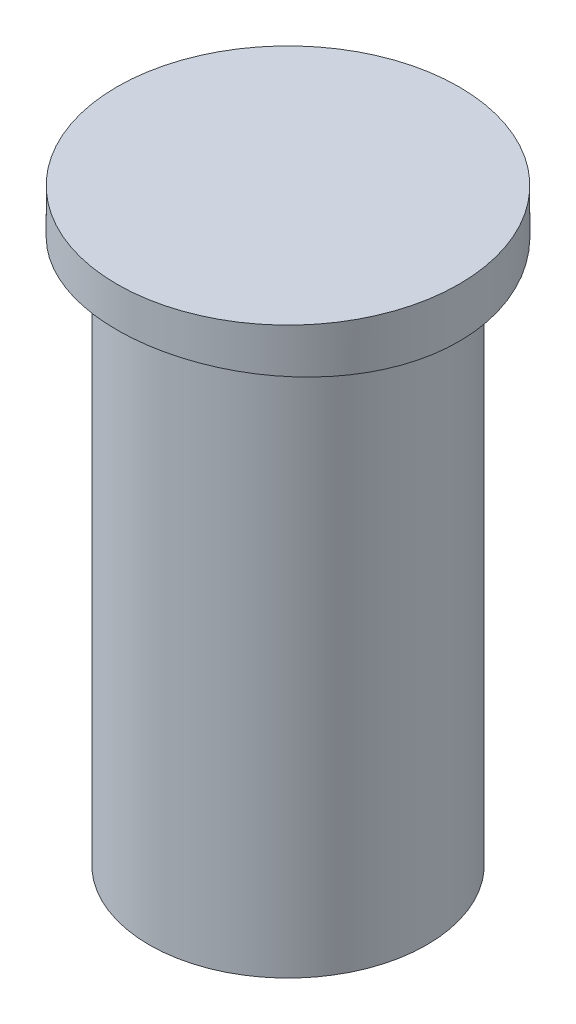
ISO-10303-21;
HEADER;
FILE_DESCRIPTION(('STEP AP214'),'2;1');
FILE_NAME('part.step','',(''),(''),'','','');
FILE_SCHEMA(('AUTOMOTIVE_DESIGN { 1 0 10303 214 1 1 1 1 }'));
ENDSEC;
DATA;
#1=APPLICATION_CONTEXT('core data for automotive mechanical design processes');
#2=APPLICATION_PROTOCOL_DEFINITION('international standard','automotive_design',2000,#1);
#3=PRODUCT_CONTEXT('',#1,'mechanical');
#4=PRODUCT('Part','Part','',(#3));
#5=PRODUCT_RELATED_PRODUCT_CATEGORY('part','',(#4));
#6=PRODUCT_DEFINITION_FORMATION('','',#4);
#7=PRODUCT_DEFINITION_CONTEXT('part definition',#1,'design');
#8=PRODUCT_DEFINITION('design','',#6,#7);
#9=PRODUCT_DEFINITION_SHAPE('','',#8);
#10=(LENGTH_UNIT() NAMED_UNIT(*) SI_UNIT(.MILLI.,.METRE.));
#11=(NAMED_UNIT(*) PLANE_ANGLE_UNIT() SI_UNIT($,.RADIAN.));
#12=(NAMED_UNIT(*) SI_UNIT($,.STERADIAN.) SOLID_ANGLE_UNIT());
#13=UNCERTAINTY_MEASURE_WITH_UNIT(LENGTH_MEASURE(1.E-05),#10,'distance_accuracy_value','');
#14=(GEOMETRIC_REPRESENTATION_CONTEXT(3) GLOBAL_UNCERTAINTY_ASSIGNED_CONTEXT((#13)) GLOBAL_UNIT_ASSIGNED_CONTEXT((#10,
#11,#12)) REPRESENTATION_CONTEXT('',''));
#15=CARTESIAN_POINT('',(0.,0.,0.));
#16=DIRECTION('',(0.,0.,1.));
#17=DIRECTION('',(1.,0.,0.));
#18=AXIS2_PLACEMENT_3D('',#15,#16,#17);
#19=CARTESIAN_POINT('',(0.,26.2128,0.));
#20=DIRECTION('',(0.,-1.,0.));
#21=DIRECTION('',(0.,0.,-1.));
#22=AXIS2_PLACEMENT_3D('',#19,#20,#21);
#23=CYLINDRICAL_SURFACE('',#22,7.62);
#24=CARTESIAN_POINT('',(0.,26.2128,0.));
#25=DIRECTION('',(0.,1.,0.));
#26=DIRECTION('',(0.,0.,1.));
#27=AXIS2_PLACEMENT_3D('',#24,#25,#26);
#28=CIRCLE('',#27,7.62);
#29=CARTESIAN_POINT('',(0.,26.2128,7.62));
#30=VERTEX_POINT('',#29);
#31=EDGE_CURVE('E11',#30,#30,#28,.T.);
#32=ORIENTED_EDGE('',*,*,#31,.F.);
#33=EDGE_LOOP('',(#32));
#34=FACE_BOUND('',#33,.T.);
#35=CARTESIAN_POINT('',(0.,24.4484000551112,-7.62));
#36=CARTESIAN_POINT('',(-0.213309301844703,24.4484007826591,-7.62000231755182));
#37=CARTESIAN_POINT('',(-0.426584098847539,24.4473544631542,-7.61103987355529));
#38=CARTESIAN_POINT('',(-0.85167813294983,24.4431999726027,-7.57525808419976));
#39=CARTESIAN_POINT('',(-1.06349702165712,24.4400913242933,-7.54843460544647));
#40=CARTESIAN_POINT('',(-1.48425674306282,24.4318954503537,-7.47709536160163));
#41=CARTESIAN_POINT('',(-1.69319525096377,24.4268067134718,-7.43256608244371));
#42=CARTESIAN_POINT('',(-2.10662512085482,24.4147924105843,-7.32612509078066));
#43=CARTESIAN_POINT('',(-2.31111482483329,24.4078661720376,-7.26420701334011));
#44=CARTESIAN_POINT('',(-2.71391316845633,24.3923808122444,-7.12352017728956));
#45=CARTESIAN_POINT('',(-2.91222790923823,24.383823366374,-7.04476869790152));
#46=CARTESIAN_POINT('',(-3.30157531073616,24.365307771398,-6.87091488392796));
#47=CARTESIAN_POINT('',(-3.49260525792306,24.3553491067033,-6.77580652783054));
#48=CARTESIAN_POINT('',(-3.86586794793223,24.3343183996452,-6.56999701082601));
#49=CARTESIAN_POINT('',(-4.04810552913065,24.3232469802085,-6.4593045602298));
#50=CARTESIAN_POINT('',(-4.4026983794659,24.3002913047856,-6.22302619184021));
#51=CARTESIAN_POINT('',(-4.57504995754689,24.2884067487903,-6.09743476434645));
#52=CARTESIAN_POINT('',(-4.90925940653562,24.2641129063189,-5.83175115020394));
#53=CARTESIAN_POINT('',(-5.07107344701722,24.2517017438222,-5.691603997217));
#54=CARTESIAN_POINT('',(-5.3823938656701,24.2267435019434,-5.39814898240186));
#55=CARTESIAN_POINT('',(-5.53189567080015,24.2141963740013,-5.24483627339297));
#56=CARTESIAN_POINT('',(-5.81745884001042,24.1893265785569,-4.92618885630274));
#57=CARTESIAN_POINT('',(-5.95352210299385,24.1770038795436,-4.76085585247071));
#58=CARTESIAN_POINT('',(-6.21127712358077,24.1529294845448,-4.41929990748995));
#59=CARTESIAN_POINT('',(-6.33296867428133,24.1411777967815,-4.24307680961716));
#60=CARTESIAN_POINT('',(-6.56144647326084,24.118546372747,-3.88044818787453));
#61=CARTESIAN_POINT('',(-6.66818849177072,24.1076692628207,-3.69401462817467));
#62=CARTESIAN_POINT('',(-6.86558162741164,24.0871366209234,-3.31274399198257));
#63=CARTESIAN_POINT('',(-6.95623232833622,24.0774811205517,-3.11790669828736));
#64=CARTESIAN_POINT('',(-7.12076218981935,24.0596720286792,-2.72125636999965));
#65=CARTESIAN_POINT('',(-7.19464490191408,24.0515181192039,-2.51944482303948));
#66=CARTESIAN_POINT('',(-7.32514226827467,24.0369430594094,-2.11017508981697));
#67=CARTESIAN_POINT('',(-7.38175097115909,24.0305225063678,-1.90271498422057));
#68=CARTESIAN_POINT('',(-7.47701887601645,24.0196303562942,-1.48469695705839));
#69=CARTESIAN_POINT('',(-7.51576173167152,24.0151496822817,-1.27415833518056));
#70=CARTESIAN_POINT('',(-7.57540418464727,24.0082226903286,-0.850532533189693));
#71=CARTESIAN_POINT('',(-7.59630358760403,24.005776394548,-0.637445325341224));
#72=CARTESIAN_POINT('',(-7.62010162474579,24.0029891903348,-0.210264774690897));
#73=CARTESIAN_POINT('',(-7.62300114190788,24.0026481786284,0.00382851824225737));
#74=CARTESIAN_POINT('',(-7.61078011830422,24.0040811515484,0.431497240297664));
#75=CARTESIAN_POINT('',(-7.59565922535986,24.0058551775097,0.6450726592172));
#76=CARTESIAN_POINT('',(-7.54763295160396,24.0114525207322,1.06907531272079));
#77=CARTESIAN_POINT('',(-7.51481933509633,24.0152652632358,1.27951308387396));
#78=CARTESIAN_POINT('',(-7.43169795187057,24.0248253824439,1.69693127158621));
#79=CARTESIAN_POINT('',(-7.38138416474365,24.0305734249084,1.90391047261317));
#80=CARTESIAN_POINT('',(-7.26364140016612,24.0438388892576,2.31282122682063));
#81=CARTESIAN_POINT('',(-7.19621833431752,24.0513556999319,2.51475449705353));
#82=CARTESIAN_POINT('',(-7.04475293040603,24.0679435688553,2.91224628565774));
#83=CARTESIAN_POINT('',(-6.96070443675046,24.0770152026136,3.10780241154721));
#84=CARTESIAN_POINT('',(-6.68406339241578,24.1062308439494,3.68359269770601));
#85=CARTESIAN_POINT('',(-6.4671355723952,24.128356565935,4.0523938121702));
#86=CARTESIAN_POINT('',(-5.97495693197852,24.1753795942497,4.74828423757212));
#87=CARTESIAN_POINT('',(-5.699703793144,24.2002770107352,5.07537188956656));
#88=CARTESIAN_POINT('',(-5.09661941683097,24.2502278102805,5.68088257827205));
#89=CARTESIAN_POINT('',(-4.76848272896918,24.2752812331489,5.95900196856705));
#90=CARTESIAN_POINT('',(-4.07002745474543,24.3225790896478,6.45624421234058));
#91=CARTESIAN_POINT('',(-3.69970879157904,24.3448235181637,6.6753669583963));
#92=CARTESIAN_POINT('',(-2.92716846339001,24.3840088701951,7.0484115973862));
#93=CARTESIAN_POINT('',(-2.52493816463793,24.4009483522763,7.20231577345239));
#94=CARTESIAN_POINT('',(-1.70010377791969,24.4276014808988,7.44031447472067));
#95=CARTESIAN_POINT('',(-1.27750051864089,24.4373154210814,7.52441183684303));
#96=CARTESIAN_POINT('',(-0.42654606998986,24.4483850351925,7.62002051938336));
#97=CARTESIAN_POINT('',(0.00175743686538807,24.4497889594554,7.63195087104587));
#98=CARTESIAN_POINT('',(0.854262252530948,24.4442102274688,7.58398913579275));
#99=CARTESIAN_POINT('',(1.27846363685452,24.4372277258968,7.52409837353127));
#100=CARTESIAN_POINT('',(2.10949301723393,24.415691277697,7.33454729256085));
#101=CARTESIAN_POINT('',(2.51636690086045,24.4011588743144,7.20508545527688));
#102=CARTESIAN_POINT('',(3.30263517133772,24.3661497860712,6.88025496950932));
#103=CARTESIAN_POINT('',(3.68202873773464,24.3456729238238,6.6848843542341));
#104=CARTESIAN_POINT('',(4.40440359075787,24.3009438100078,6.23282507553439));
#105=CARTESIAN_POINT('',(4.74721307142257,24.2766749596827,5.97586403642298));
#106=CARTESIAN_POINT('',(5.38510711112078,24.2271186284779,5.4080582973211));
#107=CARTESIAN_POINT('',(5.68019003168756,24.2018311126643,5.097211748184));
#108=CARTESIAN_POINT('',(6.08120731825299,24.1652178988383,4.59669103550206));
#109=CARTESIAN_POINT('',(6.20826072336834,24.1531993844036,4.42357547021128));
#110=CARTESIAN_POINT('',(6.4473259140529,24.1299609932277,4.06722701958631));
#111=CARTESIAN_POINT('',(6.55934323809023,24.1187408231398,3.88399789482296));
#112=CARTESIAN_POINT('',(6.76756791855526,24.0974162333154,3.50863621253876));
#113=CARTESIAN_POINT('',(6.86376973899205,24.0873122046724,3.31650056745889));
#114=CARTESIAN_POINT('',(7.03960234921305,24.0685170576899,2.924800946534));
#115=CARTESIAN_POINT('',(7.11923898927907,24.0598254407707,2.72523962265055));
#116=CARTESIAN_POINT('',(7.26124465161376,24.044118886108,2.32048039073871));
#117=CARTESIAN_POINT('',(7.32365014800879,24.0371004111046,2.11529541525679));
#118=CARTESIAN_POINT('',(7.43095800280208,24.0249190231009,1.70034847746991));
#119=CARTESIAN_POINT('',(7.4758607641792,24.0197560673798,1.49058662065944));
#120=CARTESIAN_POINT('',(7.54783026271936,24.011435258073,1.06798875019028));
#121=CARTESIAN_POINT('',(7.57489726472063,24.0082773747146,0.855152782226173));
#122=CARTESIAN_POINT('',(7.61099335134919,24.0040584327286,0.427939652790986));
#123=CARTESIAN_POINT('',(7.62002279113364,24.0029973328155,0.213562521748608));
#124=CARTESIAN_POINT('',(7.61997725543662,24.0030026617584,-0.213936962252688));
#125=CARTESIAN_POINT('',(7.61100766673554,24.0040567061548,-0.427059334086645));
#126=CARTESIAN_POINT('',(7.57524774666085,24.0082364626854,-0.851708246333416));
#127=CARTESIAN_POINT('',(7.54846364105963,24.01136145107,-1.06323531815826));
#128=CARTESIAN_POINT('',(7.4772724125237,24.0195934193584,-1.48330273372127));
#129=CARTESIAN_POINT('',(7.43286207971339,24.0247007602607,-1.69184252628147));
#130=CARTESIAN_POINT('',(7.32674604908334,24.0367509859104,-2.10441456253235));
#131=CARTESIAN_POINT('',(7.26504072140854,24.0436938313744,-2.30844690259007));
#132=CARTESIAN_POINT('',(7.12480195363852,24.059215003075,-2.71051990246561));
#133=CARTESIAN_POINT('',(7.04627284924475,24.0677929078732,-2.90856209104372));
#134=CARTESIAN_POINT('',(6.87294403352303,24.0863416925278,-3.29732232380574));
#135=CARTESIAN_POINT('',(6.77814449293142,24.0963125577666,-3.48804044482018));
#136=CARTESIAN_POINT('',(6.57293073537489,24.1173675216562,-3.86086357208934));
#137=CARTESIAN_POINT('',(6.46251361696655,24.1284518270514,-4.0429669694874));
#138=CARTESIAN_POINT('',(6.22689981461322,24.1514160201752,-4.39719812178504));
#139=CARTESIAN_POINT('',(6.10170846762599,24.1632956199492,-4.56932944564309));
#140=CARTESIAN_POINT('',(5.83657350211018,24.187595951425,-4.90352784879497));
#141=CARTESIAN_POINT('',(5.69654375986671,24.2000195657264,-5.06552640054715));
#142=CARTESIAN_POINT('',(5.40341128254603,24.2249833020407,-5.37710727406517));
#143=CARTESIAN_POINT('',(5.25031331686017,24.2375233800723,-5.52669408665748));
#144=CARTESIAN_POINT('',(4.93197294616355,24.2623786274256,-5.8125583787442));
#145=CARTESIAN_POINT('',(4.76672324534122,24.2746936559979,-5.94882774630461));
#146=CARTESIAN_POINT('',(4.42537848288755,24.2987393551779,-6.20694725259561));
#147=CARTESIAN_POINT('',(4.24928744960085,24.3104702399419,-6.32880269856653));
#148=CARTESIAN_POINT('',(3.88676341272576,24.3330638090549,-6.55771261722139));
#149=CARTESIAN_POINT('',(3.7002945234047,24.3439231171773,-6.66471060401995));
#150=CARTESIAN_POINT('',(3.31900259249316,24.3644126141161,-6.86256066565986));
#151=CARTESIAN_POINT('',(3.12418264651588,24.3740432532072,-6.95341866019999));
#152=CARTESIAN_POINT('',(2.72765884287154,24.3917989849888,-7.11831013276831));
#153=CARTESIAN_POINT('',(2.52596060106687,24.3999252726492,-7.19235697528254));
#154=CARTESIAN_POINT('',(2.11704304156786,24.4144488882108,-7.32315600806028));
#155=CARTESIAN_POINT('',(1.90982505879719,24.4208466300563,-7.37991233939163));
#156=CARTESIAN_POINT('',(1.42200067864548,24.4335326889374,-7.49158916094565));
#157=CARTESIAN_POINT('',(1.13978766339356,24.4390850741923,-7.53969487155561));
#158=CARTESIAN_POINT('',(0.571695767412095,24.4465182586492,-7.60389864075517));
#159=CARTESIAN_POINT('',(0.285816909064177,24.4483990802569,-7.61999689467129));
#160=CARTESIAN_POINT('',(0.,24.4484000551112,-7.62));
#161=B_SPLINE_CURVE_WITH_KNOTS('',3,(#35,#36,#37,#38,#39,#40,#41,#42,#43,#44,#45,#46,#47,#48,
#49,#50,#51,#52,#53,#54,#55,#56,#57,#58,#59,#60,#61,#62,#63,#64,#65,#66,#67,#68,#69,#70,#71,#72,
#73,#74,#75,#76,#77,#78,#79,#80,#81,#82,#83,#84,#85,#86,#87,#88,#89,#90,#91,#92,#93,#94,#95,#96,
#97,#98,#99,#100,#101,#102,#103,#104,#105,#106,#107,#108,#109,#110,#111,#112,#113,#114,#115,
#116,#117,#118,#119,#120,#121,#122,#123,#124,#125,#126,#127,#128,#129,#130,#131,#132,#133,#134,
#135,#136,#137,#138,#139,#140,#141,#142,#143,#144,#145,#146,#147,#148,#149,#150,#151,#152,#153,
#154,#155,#156,#157,#158,#159,#160),.UNSPECIFIED.,.T.,.F.,(4,2,2,2,2,2,2,2,2,2,2,2,2,2,2,2,2,2,
2,2,2,2,2,2,2,2,2,2,2,2,2,2,2,2,2,2,2,2,2,2,2,2,2,2,2,2,2,2,2,2,2,2,2,2,2,2,2,2,2,2,2,2,4),(0.,
0.639677853360903,1.27950379221421,1.91981902265365,2.56036893803121,3.20026446971866,
3.84039607451817,4.48017130496593,5.1201838686933,5.76270780326468,6.40546931936786,
7.0481398811591,7.69081969405576,8.33536249481337,8.979921964423,9.62434478573662,
10.2689893787918,10.9105840979458,11.5521858057287,12.1937560397519,12.8353388123923,
13.4736255465908,14.1121320817341,14.7504182996289,15.3889412879214,16.6676994479168,
17.9465084482411,19.2329874713035,20.5194688368086,21.8062994560924,23.0930777765473,
24.3723773068322,25.6516532423373,26.9272987195719,28.2029822668617,29.4844149732622,
30.7658916622879,31.4104786766297,32.0548276050602,32.6994016005938,33.3437475656435,
33.98671896491,34.6296755596787,35.2726226071486,35.915556994953,36.5547378979512,
37.1936955389106,37.8327695925472,38.4718299698595,39.110725850869,39.7496150279359,
40.3886230545187,41.027400952026,41.6701137302295,42.3125929381461,42.9554610857733,
43.5980917861014,44.2431024333068,44.8878760179483,45.5321352131831,46.1762399871735,
47.0333608956566,47.8904765735164),.UNSPECIFIED.);
#162=CARTESIAN_POINT('',(0.,24.4484000551112,-7.62));
#163=VERTEX_POINT('',#162);
#164=EDGE_CURVE('E52',#163,#163,#161,.T.);
#165=ORIENTED_EDGE('',*,*,#164,.T.);
#166=EDGE_LOOP('',(#165));
#167=FACE_BOUND('',#166,.T.);
#168=ADVANCED_FACE('F47',(#34,#167),#23,.T.);
#169=CARTESIAN_POINT('',(0.,26.2128,0.));
#170=DIRECTION('',(0.,1.,0.));
#171=DIRECTION('',(0.,0.,1.));
#172=AXIS2_PLACEMENT_3D('',#169,#170,#171);
#173=PLANE('',#172);
#174=ORIENTED_EDGE('',*,*,#31,.T.);
#175=EDGE_LOOP('',(#174));
#176=FACE_BOUND('',#175,.T.);
#177=ADVANCED_FACE('F67',(#176),#173,.T.);
#178=CARTESIAN_POINT('',(0.,-40.9565999448888,-7.62));
#179=DIRECTION('',(0.,0.,1.));
#180=DIRECTION('',(1.,0.,0.));
#181=AXIS2_PLACEMENT_3D('',#178,#179,#180);
#182=CYLINDRICAL_SURFACE('',#181,65.405);
#183=ORIENTED_EDGE('',*,*,#164,.F.);
#184=EDGE_LOOP('',(#183));
#185=FACE_BOUND('',#184,.T.);
#186=ADVANCED_FACE('F49',(#185),#182,.F.);
#187=CLOSED_SHELL('',(#168,#177,#186));
#188=MANIFOLD_SOLID_BREP('B2',#187);
#189=CARTESIAN_POINT('',(0.,0.,0.));
#190=DIRECTION('',(0.,1.,0.));
#191=DIRECTION('',(0.,0.,1.));
#192=AXIS2_PLACEMENT_3D('',#189,#190,#191);
#193=PLANE('',#192);
#194=CARTESIAN_POINT('',(0.,0.,0.));
#195=DIRECTION('',(0.,1.,0.));
#196=DIRECTION('',(0.,0.,1.));
#197=AXIS2_PLACEMENT_3D('',#194,#195,#196);
#198=CIRCLE('',#197,6.1849);
#199=CARTESIAN_POINT('',(0.,0.,6.1849));
#200=VERTEX_POINT('',#199);
#201=EDGE_CURVE('E46',#200,#200,#198,.T.);
#202=ORIENTED_EDGE('',*,*,#201,.F.);
#203=EDGE_LOOP('',(#202));
#204=FACE_BOUND('',#203,.T.);
#205=ADVANCED_FACE('F95',(#204),#193,.F.);
#206=CARTESIAN_POINT('',(0.,23.9776,0.));
#207=DIRECTION('',(0.,-1.,0.));
#208=DIRECTION('',(0.,0.,-1.));
#209=AXIS2_PLACEMENT_3D('',#206,#207,#208);
#210=CYLINDRICAL_SURFACE('',#209,6.1849);
#211=ORIENTED_EDGE('',*,*,#201,.T.);
#212=EDGE_LOOP('',(#211));
#213=FACE_BOUND('',#212,.T.);
#214=CARTESIAN_POINT('',(0.,24.003,0.));
#215=DIRECTION('',(0.,-1.,0.));
#216=DIRECTION('',(0.,0.,-1.));
#217=AXIS2_PLACEMENT_3D('',#214,#215,#216);
#218=CIRCLE('',#217,6.1849);
#219=CARTESIAN_POINT('',(0.,24.003,-6.1849));
#220=VERTEX_POINT('',#219);
#221=EDGE_CURVE('E102',#220,#220,#218,.T.);
#222=ORIENTED_EDGE('',*,*,#221,.T.);
#223=EDGE_LOOP('',(#222));
#224=FACE_BOUND('',#223,.T.);
#225=ADVANCED_FACE('F97',(#213,#224),#210,.T.);
#226=CARTESIAN_POINT('',(-7.62,24.003,-7.62));
#227=DIRECTION('',(0.,-1.,0.));
#228=DIRECTION('',(0.,0.,-1.));
#229=AXIS2_PLACEMENT_3D('',#226,#227,#228);
#230=PLANE('',#229);
#231=ORIENTED_EDGE('',*,*,#221,.F.);
#232=EDGE_LOOP('',(#231));
#233=FACE_BOUND('',#232,.T.);
#234=ADVANCED_FACE('F109',(#233),#230,.F.);
#235=CLOSED_SHELL('',(#205,#225,#234));
#236=MANIFOLD_SOLID_BREP('B6',#235);
#237=ADVANCED_BREP_SHAPE_REPRESENTATION('',(#18,#188,#236),#14);
#238=SHAPE_DEFINITION_REPRESENTATION(#9,#237);
ENDSEC;
END-ISO-10303-21;
